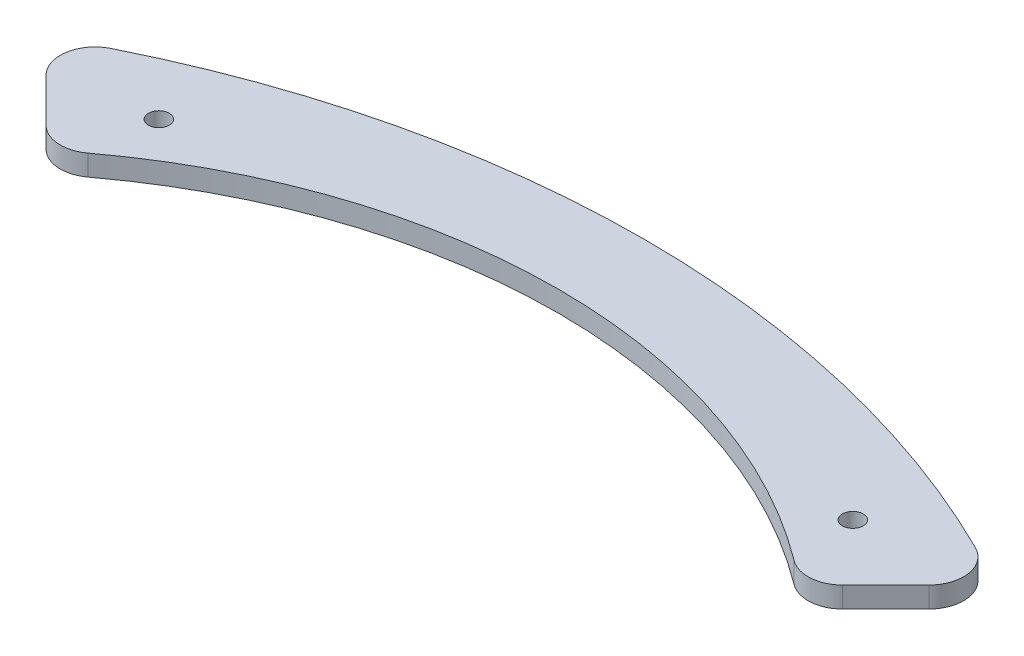
ISO-10303-21;
HEADER;
FILE_DESCRIPTION(('STEP AP214'),'2;1');
FILE_NAME('part.step','',(''),(''),'','','');
FILE_SCHEMA(('AUTOMOTIVE_DESIGN { 1 0 10303 214 1 1 1 1 }'));
ENDSEC;
DATA;
#1=APPLICATION_CONTEXT('core data for automotive mechanical design processes');
#2=APPLICATION_PROTOCOL_DEFINITION('international standard','automotive_design',2000,#1);
#3=PRODUCT_CONTEXT('',#1,'mechanical');
#4=PRODUCT('Part','Part','',(#3));
#5=PRODUCT_RELATED_PRODUCT_CATEGORY('part','',(#4));
#6=PRODUCT_DEFINITION_FORMATION('','',#4);
#7=PRODUCT_DEFINITION_CONTEXT('part definition',#1,'design');
#8=PRODUCT_DEFINITION('design','',#6,#7);
#9=PRODUCT_DEFINITION_SHAPE('','',#8);
#10=(LENGTH_UNIT() NAMED_UNIT(*) SI_UNIT(.MILLI.,.METRE.));
#11=(NAMED_UNIT(*) PLANE_ANGLE_UNIT() SI_UNIT($,.RADIAN.));
#12=(NAMED_UNIT(*) SI_UNIT($,.STERADIAN.) SOLID_ANGLE_UNIT());
#13=UNCERTAINTY_MEASURE_WITH_UNIT(LENGTH_MEASURE(1.E-05),#10,'distance_accuracy_value','');
#14=(GEOMETRIC_REPRESENTATION_CONTEXT(3) GLOBAL_UNCERTAINTY_ASSIGNED_CONTEXT((#13)) GLOBAL_UNIT_ASSIGNED_CONTEXT((#10,
#11,#12)) REPRESENTATION_CONTEXT('',''));
#15=CARTESIAN_POINT('',(0.,0.,0.));
#16=DIRECTION('',(0.,0.,1.));
#17=DIRECTION('',(1.,0.,0.));
#18=AXIS2_PLACEMENT_3D('',#15,#16,#17);
#19=CARTESIAN_POINT('',(0.,3.,0.));
#20=DIRECTION('',(0.,-1.,0.));
#21=DIRECTION('',(0.,0.,-1.));
#22=AXIS2_PLACEMENT_3D('',#19,#20,#21);
#23=CYLINDRICAL_SURFACE('',#22,140.);
#24=CARTESIAN_POINT('',(0.,3.,0.));
#25=DIRECTION('',(0.,1.,0.));
#26=DIRECTION('',(0.,0.,-1.));
#27=AXIS2_PLACEMENT_3D('',#24,#25,#26);
#28=CIRCLE('',#27,140.);
#29=CARTESIAN_POINT('',(62.3072350090683,3.,-125.370684234891));
#30=VERTEX_POINT('',#29);
#31=CARTESIAN_POINT('',(-62.3072350090684,3.,-125.370684234891));
#32=VERTEX_POINT('',#31);
#33=EDGE_CURVE('E119',#30,#32,#28,.T.);
#34=ORIENTED_EDGE('',*,*,#33,.F.);
#35=DIRECTION('',(0.,-1.,0.));
#36=VECTOR('',#35,1.);
#37=CARTESIAN_POINT('',(62.3072350090683,3.,-125.370684234891));
#38=LINE('',#37,#36);
#39=CARTESIAN_POINT('',(62.3072350090683,0.,-125.370684234891));
#40=VERTEX_POINT('',#39);
#41=EDGE_CURVE('E104',#30,#40,#38,.T.);
#42=ORIENTED_EDGE('',*,*,#41,.T.);
#43=CARTESIAN_POINT('',(0.,0.,0.));
#44=DIRECTION('',(0.,1.,0.));
#45=DIRECTION('',(0.,0.,-1.));
#46=AXIS2_PLACEMENT_3D('',#43,#44,#45);
#47=CIRCLE('',#46,140.);
#48=CARTESIAN_POINT('',(-62.3072350090684,0.,-125.370684234891));
#49=VERTEX_POINT('',#48);
#50=EDGE_CURVE('E116',#40,#49,#47,.T.);
#51=ORIENTED_EDGE('',*,*,#50,.T.);
#52=DIRECTION('',(0.,-1.,0.));
#53=VECTOR('',#52,1.);
#54=CARTESIAN_POINT('',(-62.3072350090684,3.,-125.370684234891));
#55=LINE('',#54,#53);
#56=EDGE_CURVE('E121',#49,#32,#55,.F.);
#57=ORIENTED_EDGE('',*,*,#56,.T.);
#58=EDGE_LOOP('',(#34,#42,#51,#57));
#59=FACE_BOUND('',#58,.T.);
#60=ADVANCED_FACE('F33',(#59),#23,.T.);
#61=CARTESIAN_POINT('',(-68.4084813465316,3.,-122.148596716709));
#62=DIRECTION('',(0.707106781186548,0.,-0.707106781186548));
#63=DIRECTION('',(-0.707106781186548,0.,-0.707106781186548));
#64=AXIS2_PLACEMENT_3D('',#61,#62,#63);
#65=PLANE('',#64);
#66=DIRECTION('',(0.707106781186547,0.,0.707106781186547));
#67=VECTOR('',#66,1.);
#68=CARTESIAN_POINT('',(-68.4084813465316,3.,-122.148596716709));
#69=LINE('',#68,#67);
#70=CARTESIAN_POINT('',(-63.6175105218202,3.,-117.357625891998));
#71=VERTEX_POINT('',#70);
#72=CARTESIAN_POINT('',(-57.405324756405,3.,-111.145440126583));
#73=VERTEX_POINT('',#72);
#74=EDGE_CURVE('E163',#71,#73,#69,.T.);
#75=ORIENTED_EDGE('',*,*,#74,.F.);
#76=DIRECTION('',(0.,-1.,0.));
#77=VECTOR('',#76,1.);
#78=CARTESIAN_POINT('',(-63.6175105218202,3.,-117.357625891998));
#79=LINE('',#78,#77);
#80=CARTESIAN_POINT('',(-63.6175105218202,0.,-117.357625891998));
#81=VERTEX_POINT('',#80);
#82=EDGE_CURVE('E11',#71,#81,#79,.T.);
#83=ORIENTED_EDGE('',*,*,#82,.T.);
#84=DIRECTION('',(0.707106781186547,0.,0.707106781186547));
#85=VECTOR('',#84,1.);
#86=CARTESIAN_POINT('',(-68.4084813465316,0.,-122.148596716709));
#87=LINE('',#86,#85);
#88=CARTESIAN_POINT('',(-57.405324756405,0.,-111.145440126583));
#89=VERTEX_POINT('',#88);
#90=EDGE_CURVE('E126',#81,#89,#87,.T.);
#91=ORIENTED_EDGE('',*,*,#90,.T.);
#92=DIRECTION('',(0.,-1.,0.));
#93=VECTOR('',#92,1.);
#94=CARTESIAN_POINT('',(-57.405324756405,3.,-111.145440126583));
#95=LINE('',#94,#93);
#96=EDGE_CURVE('E41',#89,#73,#95,.F.);
#97=ORIENTED_EDGE('',*,*,#96,.T.);
#98=EDGE_LOOP('',(#75,#83,#91,#97));
#99=FACE_BOUND('',#98,.T.);
#100=ADVANCED_FACE('F162',(#99),#65,.F.);
#101=CARTESIAN_POINT('',(0.,3.,-42.5835008886777));
#102=DIRECTION('',(0.,-1.,0.));
#103=DIRECTION('',(0.,0.,-1.));
#104=AXIS2_PLACEMENT_3D('',#101,#102,#103);
#105=CYLINDRICAL_SURFACE('',#104,85.);
#106=CARTESIAN_POINT('',(0.,0.,-42.5835008886777));
#107=DIRECTION('',(0.,-1.,0.));
#108=DIRECTION('',(0.,0.,-1.));
#109=AXIS2_PLACEMENT_3D('',#106,#107,#108);
#110=CIRCLE('',#109,85.);
#111=CARTESIAN_POINT('',(-50.8770246921127,0.,-110.675558857858));
#112=VERTEX_POINT('',#111);
#113=CARTESIAN_POINT('',(50.8770246921126,0.,-110.675558857858));
#114=VERTEX_POINT('',#113);
#115=EDGE_CURVE('E130',#112,#114,#110,.T.);
#116=ORIENTED_EDGE('',*,*,#115,.T.);
#117=DIRECTION('',(0.,-1.,0.));
#118=VECTOR('',#117,1.);
#119=CARTESIAN_POINT('',(50.8770246921126,3.,-110.675558857858));
#120=LINE('',#119,#118);
#121=CARTESIAN_POINT('',(50.8770246921126,3.,-110.675558857858));
#122=VERTEX_POINT('',#121);
#123=EDGE_CURVE('E48',#114,#122,#120,.F.);
#124=ORIENTED_EDGE('',*,*,#123,.T.);
#125=CARTESIAN_POINT('',(0.,3.,-42.5835008886777));
#126=DIRECTION('',(0.,-1.,0.));
#127=DIRECTION('',(0.,0.,-1.));
#128=AXIS2_PLACEMENT_3D('',#125,#126,#127);
#129=CIRCLE('',#128,85.);
#130=CARTESIAN_POINT('',(-50.8770246921127,3.,-110.675558857858));
#131=VERTEX_POINT('',#130);
#132=EDGE_CURVE('E169',#131,#122,#129,.T.);
#133=ORIENTED_EDGE('',*,*,#132,.F.);
#134=DIRECTION('',(0.,-1.,0.));
#135=VECTOR('',#134,1.);
#136=CARTESIAN_POINT('',(-50.8770246921127,3.,-110.675558857858));
#137=LINE('',#136,#135);
#138=EDGE_CURVE('E156',#131,#112,#137,.T.);
#139=ORIENTED_EDGE('',*,*,#138,.T.);
#140=EDGE_LOOP('',(#116,#124,#133,#139));
#141=FACE_BOUND('',#140,.T.);
#142=ADVANCED_FACE('F173',(#141),#105,.F.);
#143=CARTESIAN_POINT('',(68.4084813465315,3.,-122.148596716709));
#144=DIRECTION('',(-0.707106781186548,0.,-0.707106781186547));
#145=DIRECTION('',(-0.707106781186547,0.,0.707106781186548));
#146=AXIS2_PLACEMENT_3D('',#143,#144,#145);
#147=PLANE('',#146);
#148=DIRECTION('',(0.707106781186547,0.,-0.707106781186548));
#149=VECTOR('',#148,1.);
#150=CARTESIAN_POINT('',(68.4084813465315,0.,-122.148596716709));
#151=LINE('',#150,#149);
#152=CARTESIAN_POINT('',(57.4053247564049,0.,-111.145440126583));
#153=VERTEX_POINT('',#152);
#154=CARTESIAN_POINT('',(63.61751052182,0.,-117.357625891998));
#155=VERTEX_POINT('',#154);
#156=EDGE_CURVE('E140',#153,#155,#151,.T.);
#157=ORIENTED_EDGE('',*,*,#156,.T.);
#158=DIRECTION('',(0.,-1.,0.));
#159=VECTOR('',#158,1.);
#160=CARTESIAN_POINT('',(63.61751052182,3.,-117.357625891998));
#161=LINE('',#160,#159);
#162=CARTESIAN_POINT('',(63.61751052182,3.,-117.357625891998));
#163=VERTEX_POINT('',#162);
#164=EDGE_CURVE('E105',#155,#163,#161,.F.);
#165=ORIENTED_EDGE('',*,*,#164,.T.);
#166=DIRECTION('',(0.707106781186547,0.,-0.707106781186548));
#167=VECTOR('',#166,1.);
#168=CARTESIAN_POINT('',(68.4084813465315,3.,-122.148596716709));
#169=LINE('',#168,#167);
#170=CARTESIAN_POINT('',(57.4053247564049,3.,-111.145440126583));
#171=VERTEX_POINT('',#170);
#172=EDGE_CURVE('E136',#171,#163,#169,.T.);
#173=ORIENTED_EDGE('',*,*,#172,.F.);
#174=DIRECTION('',(0.,-1.,0.));
#175=VECTOR('',#174,1.);
#176=CARTESIAN_POINT('',(57.4053247564049,3.,-111.145440126583));
#177=LINE('',#176,#175);
#178=EDGE_CURVE('E110',#171,#153,#177,.T.);
#179=ORIENTED_EDGE('',*,*,#178,.T.);
#180=EDGE_LOOP('',(#157,#165,#173,#179));
#181=FACE_BOUND('',#180,.T.);
#182=ADVANCED_FACE('F180',(#181),#147,.F.);
#183=CARTESIAN_POINT('',(0.,3.,0.));
#184=DIRECTION('',(0.,-1.,0.));
#185=DIRECTION('',(0.,0.,-1.));
#186=AXIS2_PLACEMENT_3D('',#183,#184,#185);
#187=PLANE('',#186);
#188=CARTESIAN_POINT('',(50.,3.,-120.));
#189=DIRECTION('',(0.,1.,0.));
#190=DIRECTION('',(0.,0.,1.));
#191=AXIS2_PLACEMENT_3D('',#188,#189,#190);
#192=CIRCLE('',#191,1.5);
#193=CARTESIAN_POINT('',(50.,3.,-118.5));
#194=VERTEX_POINT('',#193);
#195=EDGE_CURVE('E184',#194,#194,#192,.T.);
#196=ORIENTED_EDGE('',*,*,#195,.F.);
#197=EDGE_LOOP('',(#196));
#198=FACE_BOUND('',#197,.T.);
#199=CARTESIAN_POINT('',(-50.,3.,-120.));
#200=DIRECTION('',(0.,1.,0.));
#201=DIRECTION('',(0.,0.,1.));
#202=AXIS2_PLACEMENT_3D('',#199,#200,#201);
#203=CIRCLE('',#202,1.5);
#204=CARTESIAN_POINT('',(-50.,3.,-118.5));
#205=VERTEX_POINT('',#204);
#206=EDGE_CURVE('E127',#205,#205,#203,.T.);
#207=ORIENTED_EDGE('',*,*,#206,.F.);
#208=EDGE_LOOP('',(#207));
#209=FACE_BOUND('',#208,.T.);
#210=ORIENTED_EDGE('',*,*,#172,.T.);
#211=CARTESIAN_POINT('',(60.0819766158873,3.,-120.89315979793));
#212=DIRECTION('',(0.,-1.,0.));
#213=DIRECTION('',(0.,0.,-1.));
#214=AXIS2_PLACEMENT_3D('',#211,#212,#213);
#215=CIRCLE('',#214,5.);
#216=EDGE_CURVE('E154',#163,#30,#215,.F.);
#217=ORIENTED_EDGE('',*,*,#216,.T.);
#218=ORIENTED_EDGE('',*,*,#33,.T.);
#219=CARTESIAN_POINT('',(-60.0819766158874,3.,-120.89315979793));
#220=DIRECTION('',(0.,-1.,0.));
#221=DIRECTION('',(0.,0.,-1.));
#222=AXIS2_PLACEMENT_3D('',#219,#220,#221);
#223=CIRCLE('',#222,5.);
#224=EDGE_CURVE('E150',#32,#71,#223,.F.);
#225=ORIENTED_EDGE('',*,*,#224,.T.);
#226=ORIENTED_EDGE('',*,*,#74,.T.);
#227=CARTESIAN_POINT('',(-53.8697908504723,3.,-114.680974032515));
#228=DIRECTION('',(0.,-1.,0.));
#229=DIRECTION('',(0.,0.,-1.));
#230=AXIS2_PLACEMENT_3D('',#227,#228,#229);
#231=CIRCLE('',#230,5.);
#232=EDGE_CURVE('E55',#73,#131,#231,.F.);
#233=ORIENTED_EDGE('',*,*,#232,.T.);
#234=ORIENTED_EDGE('',*,*,#132,.T.);
#235=CARTESIAN_POINT('',(53.8697908504722,3.,-114.680974032515));
#236=DIRECTION('',(0.,-1.,0.));
#237=DIRECTION('',(0.,0.,-1.));
#238=AXIS2_PLACEMENT_3D('',#235,#236,#237);
#239=CIRCLE('',#238,5.);
#240=EDGE_CURVE('E152',#122,#171,#239,.F.);
#241=ORIENTED_EDGE('',*,*,#240,.T.);
#242=EDGE_LOOP('',(#210,#217,#218,#225,#226,#233,#234,#241));
#243=FACE_BOUND('',#242,.T.);
#244=ADVANCED_FACE('F167',(#198,#209,#243),#187,.F.);
#245=CARTESIAN_POINT('',(0.,0.,0.));
#246=DIRECTION('',(0.,-1.,0.));
#247=DIRECTION('',(0.,0.,-1.));
#248=AXIS2_PLACEMENT_3D('',#245,#246,#247);
#249=PLANE('',#248);
#250=CARTESIAN_POINT('',(50.,0.,-120.));
#251=DIRECTION('',(0.,-1.,0.));
#252=DIRECTION('',(0.,0.,-1.));
#253=AXIS2_PLACEMENT_3D('',#250,#251,#252);
#254=CIRCLE('',#253,1.5);
#255=CARTESIAN_POINT('',(50.,0.,-121.5));
#256=VERTEX_POINT('',#255);
#257=EDGE_CURVE('E186',#256,#256,#254,.F.);
#258=ORIENTED_EDGE('',*,*,#257,.T.);
#259=EDGE_LOOP('',(#258));
#260=FACE_BOUND('',#259,.T.);
#261=CARTESIAN_POINT('',(-50.,0.,-120.));
#262=DIRECTION('',(0.,-1.,0.));
#263=DIRECTION('',(0.,0.,-1.));
#264=AXIS2_PLACEMENT_3D('',#261,#262,#263);
#265=CIRCLE('',#264,1.5);
#266=CARTESIAN_POINT('',(-50.,0.,-121.5));
#267=VERTEX_POINT('',#266);
#268=EDGE_CURVE('E133',#267,#267,#265,.F.);
#269=ORIENTED_EDGE('',*,*,#268,.T.);
#270=EDGE_LOOP('',(#269));
#271=FACE_BOUND('',#270,.T.);
#272=ORIENTED_EDGE('',*,*,#50,.F.);
#273=CARTESIAN_POINT('',(60.0819766158873,0.,-120.89315979793));
#274=DIRECTION('',(0.,-1.,0.));
#275=DIRECTION('',(0.,0.,-1.));
#276=AXIS2_PLACEMENT_3D('',#273,#274,#275);
#277=CIRCLE('',#276,5.);
#278=EDGE_CURVE('E100',#40,#155,#277,.T.);
#279=ORIENTED_EDGE('',*,*,#278,.T.);
#280=ORIENTED_EDGE('',*,*,#156,.F.);
#281=CARTESIAN_POINT('',(53.8697908504722,0.,-114.680974032515));
#282=DIRECTION('',(0.,-1.,0.));
#283=DIRECTION('',(0.,0.,-1.));
#284=AXIS2_PLACEMENT_3D('',#281,#282,#283);
#285=CIRCLE('',#284,5.);
#286=EDGE_CURVE('E111',#153,#114,#285,.T.);
#287=ORIENTED_EDGE('',*,*,#286,.T.);
#288=ORIENTED_EDGE('',*,*,#115,.F.);
#289=CARTESIAN_POINT('',(-53.8697908504723,0.,-114.680974032515));
#290=DIRECTION('',(0.,-1.,0.));
#291=DIRECTION('',(0.,0.,-1.));
#292=AXIS2_PLACEMENT_3D('',#289,#290,#291);
#293=CIRCLE('',#292,5.);
#294=EDGE_CURVE('E120',#112,#89,#293,.T.);
#295=ORIENTED_EDGE('',*,*,#294,.T.);
#296=ORIENTED_EDGE('',*,*,#90,.F.);
#297=CARTESIAN_POINT('',(-60.0819766158874,0.,-120.89315979793));
#298=DIRECTION('',(0.,-1.,0.));
#299=DIRECTION('',(0.,0.,-1.));
#300=AXIS2_PLACEMENT_3D('',#297,#298,#299);
#301=CIRCLE('',#300,5.);
#302=EDGE_CURVE('E125',#81,#49,#301,.T.);
#303=ORIENTED_EDGE('',*,*,#302,.T.);
#304=EDGE_LOOP('',(#272,#279,#280,#287,#288,#295,#296,#303));
#305=FACE_BOUND('',#304,.T.);
#306=ADVANCED_FACE('F123',(#260,#271,#305),#249,.T.);
#307=CARTESIAN_POINT('',(60.0819766158873,3.,-120.89315979793));
#308=DIRECTION('',(0.,-1.,0.));
#309=DIRECTION('',(0.,0.,-1.));
#310=AXIS2_PLACEMENT_3D('',#307,#308,#309);
#311=CYLINDRICAL_SURFACE('',#310,5.);
#312=ORIENTED_EDGE('',*,*,#216,.F.);
#313=ORIENTED_EDGE('',*,*,#164,.F.);
#314=ORIENTED_EDGE('',*,*,#278,.F.);
#315=ORIENTED_EDGE('',*,*,#41,.F.);
#316=EDGE_LOOP('',(#312,#313,#314,#315));
#317=FACE_BOUND('',#316,.T.);
#318=ADVANCED_FACE('F103',(#317),#311,.T.);
#319=CARTESIAN_POINT('',(53.8697908504722,3.,-114.680974032515));
#320=DIRECTION('',(0.,-1.,0.));
#321=DIRECTION('',(0.,0.,-1.));
#322=AXIS2_PLACEMENT_3D('',#319,#320,#321);
#323=CYLINDRICAL_SURFACE('',#322,5.);
#324=ORIENTED_EDGE('',*,*,#240,.F.);
#325=ORIENTED_EDGE('',*,*,#123,.F.);
#326=ORIENTED_EDGE('',*,*,#286,.F.);
#327=ORIENTED_EDGE('',*,*,#178,.F.);
#328=EDGE_LOOP('',(#324,#325,#326,#327));
#329=FACE_BOUND('',#328,.T.);
#330=ADVANCED_FACE('F177',(#329),#323,.T.);
#331=CARTESIAN_POINT('',(-60.0819766158874,3.,-120.89315979793));
#332=DIRECTION('',(0.,-1.,0.));
#333=DIRECTION('',(0.,0.,-1.));
#334=AXIS2_PLACEMENT_3D('',#331,#332,#333);
#335=CYLINDRICAL_SURFACE('',#334,5.);
#336=ORIENTED_EDGE('',*,*,#224,.F.);
#337=ORIENTED_EDGE('',*,*,#56,.F.);
#338=ORIENTED_EDGE('',*,*,#302,.F.);
#339=ORIENTED_EDGE('',*,*,#82,.F.);
#340=EDGE_LOOP('',(#336,#337,#338,#339));
#341=FACE_BOUND('',#340,.T.);
#342=ADVANCED_FACE('F209',(#341),#335,.T.);
#343=CARTESIAN_POINT('',(-53.8697908504723,3.,-114.680974032515));
#344=DIRECTION('',(0.,-1.,0.));
#345=DIRECTION('',(0.,0.,-1.));
#346=AXIS2_PLACEMENT_3D('',#343,#344,#345);
#347=CYLINDRICAL_SURFACE('',#346,5.);
#348=ORIENTED_EDGE('',*,*,#232,.F.);
#349=ORIENTED_EDGE('',*,*,#96,.F.);
#350=ORIENTED_EDGE('',*,*,#294,.F.);
#351=ORIENTED_EDGE('',*,*,#138,.F.);
#352=EDGE_LOOP('',(#348,#349,#350,#351));
#353=FACE_BOUND('',#352,.T.);
#354=ADVANCED_FACE('F35',(#353),#347,.T.);
#355=CARTESIAN_POINT('',(-50.,-0.00100000000000013,-120.));
#356=DIRECTION('',(0.,1.,0.));
#357=DIRECTION('',(0.,0.,1.));
#358=AXIS2_PLACEMENT_3D('',#355,#356,#357);
#359=CYLINDRICAL_SURFACE('',#358,1.5);
#360=ORIENTED_EDGE('',*,*,#268,.F.);
#361=EDGE_LOOP('',(#360));
#362=FACE_BOUND('',#361,.T.);
#363=ORIENTED_EDGE('',*,*,#206,.T.);
#364=EDGE_LOOP('',(#363));
#365=FACE_BOUND('',#364,.T.);
#366=ADVANCED_FACE('F199',(#362,#365),#359,.F.);
#367=CARTESIAN_POINT('',(50.,-0.00100000000000013,-120.));
#368=DIRECTION('',(0.,1.,0.));
#369=DIRECTION('',(0.,0.,1.));
#370=AXIS2_PLACEMENT_3D('',#367,#368,#369);
#371=CYLINDRICAL_SURFACE('',#370,1.5);
#372=ORIENTED_EDGE('',*,*,#257,.F.);
#373=EDGE_LOOP('',(#372));
#374=FACE_BOUND('',#373,.T.);
#375=ORIENTED_EDGE('',*,*,#195,.T.);
#376=EDGE_LOOP('',(#375));
#377=FACE_BOUND('',#376,.T.);
#378=ADVANCED_FACE('F192',(#374,#377),#371,.F.);
#379=CLOSED_SHELL('',(#60,#100,#142,#182,#244,#306,#318,#330,#342,#354,#366,#378));
#380=MANIFOLD_SOLID_BREP('B2',#379);
#381=ADVANCED_BREP_SHAPE_REPRESENTATION('',(#18,#380),#14);
#382=SHAPE_DEFINITION_REPRESENTATION(#9,#381);
ENDSEC;
END-ISO-10303-21;
